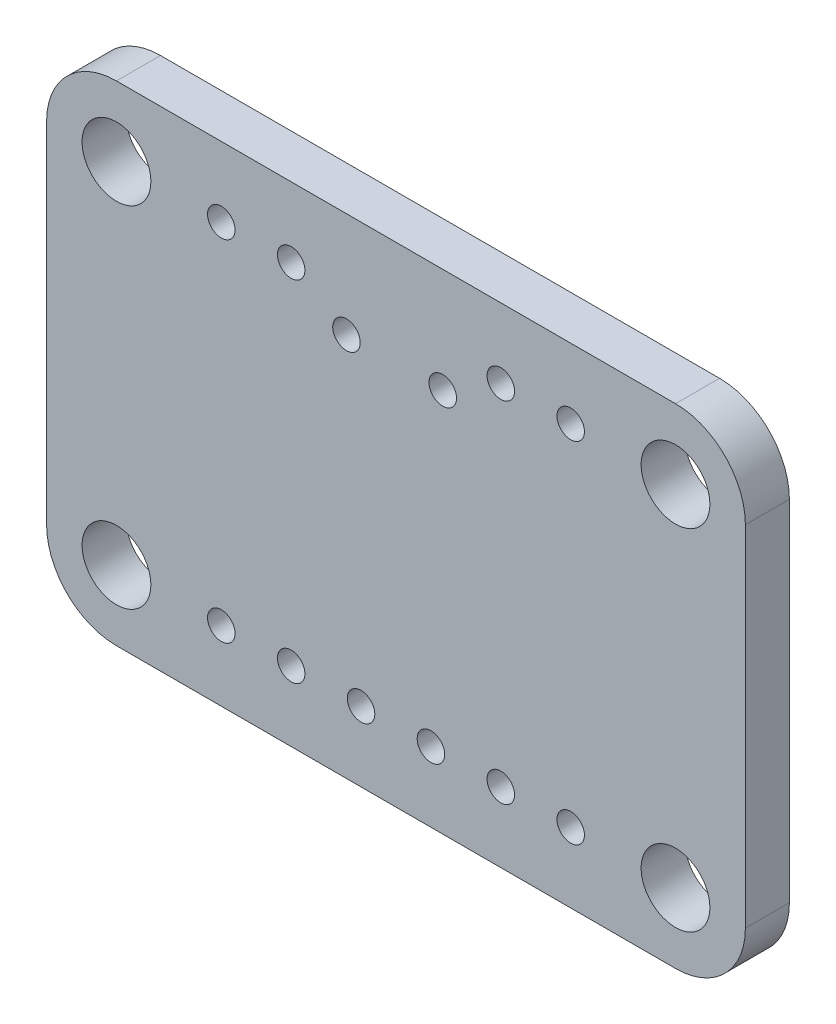
ISO-10303-21;
HEADER;
FILE_DESCRIPTION(('STEP AP214'),'2;1');
FILE_NAME('part.step','',(''),(''),'','','');
FILE_SCHEMA(('AUTOMOTIVE_DESIGN { 1 0 10303 214 1 1 1 1 }'));
ENDSEC;
DATA;
#1=APPLICATION_CONTEXT('core data for automotive mechanical design processes');
#2=APPLICATION_PROTOCOL_DEFINITION('international standard','automotive_design',2000,#1);
#3=PRODUCT_CONTEXT('',#1,'mechanical');
#4=PRODUCT('Part','Part','',(#3));
#5=PRODUCT_RELATED_PRODUCT_CATEGORY('part','',(#4));
#6=PRODUCT_DEFINITION_FORMATION('','',#4);
#7=PRODUCT_DEFINITION_CONTEXT('part definition',#1,'design');
#8=PRODUCT_DEFINITION('design','',#6,#7);
#9=PRODUCT_DEFINITION_SHAPE('','',#8);
#10=(LENGTH_UNIT() NAMED_UNIT(*) SI_UNIT(.MILLI.,.METRE.));
#11=(NAMED_UNIT(*) PLANE_ANGLE_UNIT() SI_UNIT($,.RADIAN.));
#12=(NAMED_UNIT(*) SI_UNIT($,.STERADIAN.) SOLID_ANGLE_UNIT());
#13=UNCERTAINTY_MEASURE_WITH_UNIT(LENGTH_MEASURE(1.E-05),#10,'distance_accuracy_value','');
#14=(GEOMETRIC_REPRESENTATION_CONTEXT(3) GLOBAL_UNCERTAINTY_ASSIGNED_CONTEXT((#13)) GLOBAL_UNIT_ASSIGNED_CONTEXT((#10,
#11,#12)) REPRESENTATION_CONTEXT('',''));
#15=CARTESIAN_POINT('',(0.,0.,0.));
#16=DIRECTION('',(0.,0.,1.));
#17=DIRECTION('',(1.,0.,0.));
#18=AXIS2_PLACEMENT_3D('',#15,#16,#17);
#19=CARTESIAN_POINT('',(22.86,15.24,-1.6));
#20=DIRECTION('',(0.,0.,1.));
#21=DIRECTION('',(1.,0.,0.));
#22=AXIS2_PLACEMENT_3D('',#19,#20,#21);
#23=CYLINDRICAL_SURFACE('',#22,2.54);
#24=CARTESIAN_POINT('',(22.86,15.24,0.));
#25=DIRECTION('',(0.,0.,1.));
#26=DIRECTION('',(1.,0.,0.));
#27=AXIS2_PLACEMENT_3D('',#24,#25,#26);
#28=CIRCLE('',#27,2.54);
#29=CARTESIAN_POINT('',(25.4,15.24,0.));
#30=VERTEX_POINT('',#29);
#31=CARTESIAN_POINT('',(22.86,17.78,0.));
#32=VERTEX_POINT('',#31);
#33=EDGE_CURVE('E571',#30,#32,#28,.T.);
#34=ORIENTED_EDGE('',*,*,#33,.F.);
#35=DIRECTION('',(0.,0.,1.));
#36=VECTOR('',#35,1.);
#37=CARTESIAN_POINT('',(25.4,15.24,-1.6));
#38=LINE('',#37,#36);
#39=CARTESIAN_POINT('',(25.4,15.24,-1.6));
#40=VERTEX_POINT('',#39);
#41=EDGE_CURVE('E12',#40,#30,#38,.T.);
#42=ORIENTED_EDGE('',*,*,#41,.F.);
#43=CARTESIAN_POINT('',(22.86,15.24,-1.6));
#44=DIRECTION('',(0.,0.,1.));
#45=DIRECTION('',(1.,0.,0.));
#46=AXIS2_PLACEMENT_3D('',#43,#44,#45);
#47=CIRCLE('',#46,2.54);
#48=CARTESIAN_POINT('',(22.86,17.78,-1.6));
#49=VERTEX_POINT('',#48);
#50=EDGE_CURVE('E592',#40,#49,#47,.T.);
#51=ORIENTED_EDGE('',*,*,#50,.T.);
#52=DIRECTION('',(0.,0.,1.));
#53=VECTOR('',#52,1.);
#54=CARTESIAN_POINT('',(22.86,17.78,-1.6));
#55=LINE('',#54,#53);
#56=EDGE_CURVE('E477',#49,#32,#55,.T.);
#57=ORIENTED_EDGE('',*,*,#56,.T.);
#58=EDGE_LOOP('',(#34,#42,#51,#57));
#59=FACE_BOUND('',#58,.T.);
#60=ADVANCED_FACE('F474',(#59),#23,.T.);
#61=CARTESIAN_POINT('',(25.4,2.54,-1.6));
#62=DIRECTION('',(1.,0.,0.));
#63=DIRECTION('',(0.,0.,-1.));
#64=AXIS2_PLACEMENT_3D('',#61,#62,#63);
#65=PLANE('',#64);
#66=DIRECTION('',(0.,1.,0.));
#67=VECTOR('',#66,1.);
#68=CARTESIAN_POINT('',(25.4,2.54,0.));
#69=LINE('',#68,#67);
#70=CARTESIAN_POINT('',(25.4,2.54,0.));
#71=VERTEX_POINT('',#70);
#72=EDGE_CURVE('E590',#71,#30,#69,.T.);
#73=ORIENTED_EDGE('',*,*,#72,.F.);
#74=DIRECTION('',(0.,0.,1.));
#75=VECTOR('',#74,1.);
#76=CARTESIAN_POINT('',(25.4,2.54,-1.6));
#77=LINE('',#76,#75);
#78=CARTESIAN_POINT('',(25.4,2.54,-1.6));
#79=VERTEX_POINT('',#78);
#80=EDGE_CURVE('E483',#79,#71,#77,.T.);
#81=ORIENTED_EDGE('',*,*,#80,.F.);
#82=DIRECTION('',(0.,1.,0.));
#83=VECTOR('',#82,1.);
#84=CARTESIAN_POINT('',(25.4,2.54,-1.6));
#85=LINE('',#84,#83);
#86=EDGE_CURVE('E561',#79,#40,#85,.T.);
#87=ORIENTED_EDGE('',*,*,#86,.T.);
#88=ORIENTED_EDGE('',*,*,#41,.T.);
#89=EDGE_LOOP('',(#73,#81,#87,#88));
#90=FACE_BOUND('',#89,.T.);
#91=ADVANCED_FACE('F604',(#90),#65,.T.);
#92=CARTESIAN_POINT('',(22.86,2.54,-1.6));
#93=DIRECTION('',(0.,0.,1.));
#94=DIRECTION('',(1.,0.,0.));
#95=AXIS2_PLACEMENT_3D('',#92,#93,#94);
#96=CYLINDRICAL_SURFACE('',#95,2.54);
#97=CARTESIAN_POINT('',(22.86,2.54,0.));
#98=DIRECTION('',(0.,0.,1.));
#99=DIRECTION('',(1.,0.,0.));
#100=AXIS2_PLACEMENT_3D('',#97,#98,#99);
#101=CIRCLE('',#100,2.54);
#102=CARTESIAN_POINT('',(22.86,0.,0.));
#103=VERTEX_POINT('',#102);
#104=EDGE_CURVE('E548',#103,#71,#101,.T.);
#105=ORIENTED_EDGE('',*,*,#104,.F.);
#106=DIRECTION('',(0.,0.,1.));
#107=VECTOR('',#106,1.);
#108=CARTESIAN_POINT('',(22.86,0.,-1.6));
#109=LINE('',#108,#107);
#110=CARTESIAN_POINT('',(22.86,0.,-1.6));
#111=VERTEX_POINT('',#110);
#112=EDGE_CURVE('E543',#111,#103,#109,.T.);
#113=ORIENTED_EDGE('',*,*,#112,.F.);
#114=CARTESIAN_POINT('',(22.86,2.54,-1.6));
#115=DIRECTION('',(0.,0.,1.));
#116=DIRECTION('',(1.,0.,0.));
#117=AXIS2_PLACEMENT_3D('',#114,#115,#116);
#118=CIRCLE('',#117,2.54);
#119=EDGE_CURVE('E546',#111,#79,#118,.T.);
#120=ORIENTED_EDGE('',*,*,#119,.T.);
#121=ORIENTED_EDGE('',*,*,#80,.T.);
#122=EDGE_LOOP('',(#105,#113,#120,#121));
#123=FACE_BOUND('',#122,.T.);
#124=ADVANCED_FACE('F545',(#123),#96,.T.);
#125=CARTESIAN_POINT('',(2.54,0.,-1.6));
#126=DIRECTION('',(0.,-1.,0.));
#127=DIRECTION('',(0.,0.,-1.));
#128=AXIS2_PLACEMENT_3D('',#125,#126,#127);
#129=PLANE('',#128);
#130=DIRECTION('',(1.,0.,0.));
#131=VECTOR('',#130,1.);
#132=CARTESIAN_POINT('',(2.54,0.,0.));
#133=LINE('',#132,#131);
#134=CARTESIAN_POINT('',(2.54,0.,0.));
#135=VERTEX_POINT('',#134);
#136=EDGE_CURVE('E587',#135,#103,#133,.T.);
#137=ORIENTED_EDGE('',*,*,#136,.F.);
#138=DIRECTION('',(0.,0.,1.));
#139=VECTOR('',#138,1.);
#140=CARTESIAN_POINT('',(2.54,0.,-1.6));
#141=LINE('',#140,#139);
#142=CARTESIAN_POINT('',(2.54,0.,-1.6));
#143=VERTEX_POINT('',#142);
#144=EDGE_CURVE('E553',#143,#135,#141,.T.);
#145=ORIENTED_EDGE('',*,*,#144,.F.);
#146=DIRECTION('',(1.,0.,0.));
#147=VECTOR('',#146,1.);
#148=CARTESIAN_POINT('',(2.54,0.,-1.6));
#149=LINE('',#148,#147);
#150=EDGE_CURVE('E559',#143,#111,#149,.T.);
#151=ORIENTED_EDGE('',*,*,#150,.T.);
#152=ORIENTED_EDGE('',*,*,#112,.T.);
#153=EDGE_LOOP('',(#137,#145,#151,#152));
#154=FACE_BOUND('',#153,.T.);
#155=ADVANCED_FACE('F563',(#154),#129,.T.);
#156=CARTESIAN_POINT('',(2.54,2.54,-1.6));
#157=DIRECTION('',(0.,0.,1.));
#158=DIRECTION('',(1.,0.,0.));
#159=AXIS2_PLACEMENT_3D('',#156,#157,#158);
#160=CYLINDRICAL_SURFACE('',#159,2.54);
#161=CARTESIAN_POINT('',(2.54,2.54,0.));
#162=DIRECTION('',(0.,0.,1.));
#163=DIRECTION('',(1.,0.,0.));
#164=AXIS2_PLACEMENT_3D('',#161,#162,#163);
#165=CIRCLE('',#164,2.54);
#166=CARTESIAN_POINT('',(0.,2.54,0.));
#167=VERTEX_POINT('',#166);
#168=EDGE_CURVE('E584',#167,#135,#165,.T.);
#169=ORIENTED_EDGE('',*,*,#168,.F.);
#170=DIRECTION('',(0.,0.,1.));
#171=VECTOR('',#170,1.);
#172=CARTESIAN_POINT('',(0.,2.54,-1.6));
#173=LINE('',#172,#171);
#174=CARTESIAN_POINT('',(0.,2.54,-1.6));
#175=VERTEX_POINT('',#174);
#176=EDGE_CURVE('E596',#175,#167,#173,.T.);
#177=ORIENTED_EDGE('',*,*,#176,.F.);
#178=CARTESIAN_POINT('',(2.54,2.54,-1.6));
#179=DIRECTION('',(0.,0.,1.));
#180=DIRECTION('',(1.,0.,0.));
#181=AXIS2_PLACEMENT_3D('',#178,#179,#180);
#182=CIRCLE('',#181,2.54);
#183=EDGE_CURVE('E564',#175,#143,#182,.T.);
#184=ORIENTED_EDGE('',*,*,#183,.T.);
#185=ORIENTED_EDGE('',*,*,#144,.T.);
#186=EDGE_LOOP('',(#169,#177,#184,#185));
#187=FACE_BOUND('',#186,.T.);
#188=ADVANCED_FACE('F617',(#187),#160,.T.);
#189=CARTESIAN_POINT('',(0.,15.24,-1.6));
#190=DIRECTION('',(-1.,0.,0.));
#191=DIRECTION('',(0.,0.,1.));
#192=AXIS2_PLACEMENT_3D('',#189,#190,#191);
#193=PLANE('',#192);
#194=DIRECTION('',(0.,-1.,0.));
#195=VECTOR('',#194,1.);
#196=CARTESIAN_POINT('',(0.,15.24,0.));
#197=LINE('',#196,#195);
#198=CARTESIAN_POINT('',(0.,15.24,0.));
#199=VERTEX_POINT('',#198);
#200=EDGE_CURVE('E581',#199,#167,#197,.T.);
#201=ORIENTED_EDGE('',*,*,#200,.F.);
#202=DIRECTION('',(0.,0.,1.));
#203=VECTOR('',#202,1.);
#204=CARTESIAN_POINT('',(0.,15.24,-1.6));
#205=LINE('',#204,#203);
#206=CARTESIAN_POINT('',(0.,15.24,-1.6));
#207=VERTEX_POINT('',#206);
#208=EDGE_CURVE('E598',#207,#199,#205,.T.);
#209=ORIENTED_EDGE('',*,*,#208,.F.);
#210=DIRECTION('',(0.,-1.,0.));
#211=VECTOR('',#210,1.);
#212=CARTESIAN_POINT('',(0.,15.24,-1.6));
#213=LINE('',#212,#211);
#214=EDGE_CURVE('E566',#207,#175,#213,.T.);
#215=ORIENTED_EDGE('',*,*,#214,.T.);
#216=ORIENTED_EDGE('',*,*,#176,.T.);
#217=EDGE_LOOP('',(#201,#209,#215,#216));
#218=FACE_BOUND('',#217,.T.);
#219=ADVANCED_FACE('F620',(#218),#193,.T.);
#220=CARTESIAN_POINT('',(2.54,15.24,-1.6));
#221=DIRECTION('',(0.,0.,1.));
#222=DIRECTION('',(1.,0.,0.));
#223=AXIS2_PLACEMENT_3D('',#220,#221,#222);
#224=CYLINDRICAL_SURFACE('',#223,2.54);
#225=CARTESIAN_POINT('',(2.54,15.24,0.));
#226=DIRECTION('',(0.,0.,1.));
#227=DIRECTION('',(1.,0.,0.));
#228=AXIS2_PLACEMENT_3D('',#225,#226,#227);
#229=CIRCLE('',#228,2.54);
#230=CARTESIAN_POINT('',(2.54,17.78,0.));
#231=VERTEX_POINT('',#230);
#232=EDGE_CURVE('E578',#231,#199,#229,.T.);
#233=ORIENTED_EDGE('',*,*,#232,.F.);
#234=DIRECTION('',(0.,0.,1.));
#235=VECTOR('',#234,1.);
#236=CARTESIAN_POINT('',(2.54,17.78,-1.6));
#237=LINE('',#236,#235);
#238=CARTESIAN_POINT('',(2.54,17.78,-1.6));
#239=VERTEX_POINT('',#238);
#240=EDGE_CURVE('E599',#239,#231,#237,.T.);
#241=ORIENTED_EDGE('',*,*,#240,.F.);
#242=CARTESIAN_POINT('',(2.54,15.24,-1.6));
#243=DIRECTION('',(0.,0.,1.));
#244=DIRECTION('',(1.,0.,0.));
#245=AXIS2_PLACEMENT_3D('',#242,#243,#244);
#246=CIRCLE('',#245,2.54);
#247=EDGE_CURVE('E806',#239,#207,#246,.T.);
#248=ORIENTED_EDGE('',*,*,#247,.T.);
#249=ORIENTED_EDGE('',*,*,#208,.T.);
#250=EDGE_LOOP('',(#233,#241,#248,#249));
#251=FACE_BOUND('',#250,.T.);
#252=ADVANCED_FACE('F624',(#251),#224,.T.);
#253=CARTESIAN_POINT('',(22.86,17.78,-1.6));
#254=DIRECTION('',(0.,1.,0.));
#255=DIRECTION('',(0.,0.,1.));
#256=AXIS2_PLACEMENT_3D('',#253,#254,#255);
#257=PLANE('',#256);
#258=DIRECTION('',(-1.,0.,0.));
#259=VECTOR('',#258,1.);
#260=CARTESIAN_POINT('',(22.86,17.78,0.));
#261=LINE('',#260,#259);
#262=EDGE_CURVE('E574',#32,#231,#261,.T.);
#263=ORIENTED_EDGE('',*,*,#262,.F.);
#264=ORIENTED_EDGE('',*,*,#56,.F.);
#265=DIRECTION('',(-1.,0.,0.));
#266=VECTOR('',#265,1.);
#267=CARTESIAN_POINT('',(22.86,17.78,-1.6));
#268=LINE('',#267,#266);
#269=EDGE_CURVE('E804',#49,#239,#268,.T.);
#270=ORIENTED_EDGE('',*,*,#269,.T.);
#271=ORIENTED_EDGE('',*,*,#240,.T.);
#272=EDGE_LOOP('',(#263,#264,#270,#271));
#273=FACE_BOUND('',#272,.T.);
#274=ADVANCED_FACE('F601',(#273),#257,.T.);
#275=CARTESIAN_POINT('',(22.86,15.24,-1.6));
#276=DIRECTION('',(0.,0.,1.));
#277=DIRECTION('',(1.,0.,0.));
#278=AXIS2_PLACEMENT_3D('',#275,#276,#277);
#279=PLANE('',#278);
#280=CARTESIAN_POINT('',(2.54,15.24,-1.6));
#281=DIRECTION('',(0.,0.,1.));
#282=DIRECTION('',(1.,0.,0.));
#283=AXIS2_PLACEMENT_3D('',#280,#281,#282);
#284=CIRCLE('',#283,1.25);
#285=CARTESIAN_POINT('',(3.79,15.24,-1.6));
#286=VERTEX_POINT('',#285);
#287=EDGE_CURVE('E707',#286,#286,#284,.T.);
#288=ORIENTED_EDGE('',*,*,#287,.T.);
#289=EDGE_LOOP('',(#288));
#290=FACE_BOUND('',#289,.T.);
#291=CARTESIAN_POINT('',(22.86,15.24,-1.6));
#292=DIRECTION('',(0.,0.,1.));
#293=DIRECTION('',(1.,0.,0.));
#294=AXIS2_PLACEMENT_3D('',#291,#292,#293);
#295=CIRCLE('',#294,1.25);
#296=CARTESIAN_POINT('',(24.11,15.24,-1.6));
#297=VERTEX_POINT('',#296);
#298=EDGE_CURVE('E715',#297,#297,#295,.T.);
#299=ORIENTED_EDGE('',*,*,#298,.T.);
#300=EDGE_LOOP('',(#299));
#301=FACE_BOUND('',#300,.T.);
#302=CARTESIAN_POINT('',(10.9,13.97,-1.6));
#303=DIRECTION('',(0.,0.,1.));
#304=DIRECTION('',(1.,0.,0.));
#305=AXIS2_PLACEMENT_3D('',#302,#303,#304);
#306=CIRCLE('',#305,0.5);
#307=CARTESIAN_POINT('',(11.4,13.97,-1.6));
#308=VERTEX_POINT('',#307);
#309=EDGE_CURVE('E721',#308,#308,#306,.T.);
#310=ORIENTED_EDGE('',*,*,#309,.T.);
#311=EDGE_LOOP('',(#310));
#312=FACE_BOUND('',#311,.T.);
#313=CARTESIAN_POINT('',(14.4,13.97,-1.6));
#314=DIRECTION('',(0.,0.,1.));
#315=DIRECTION('',(1.,0.,0.));
#316=AXIS2_PLACEMENT_3D('',#313,#314,#315);
#317=CIRCLE('',#316,0.5);
#318=CARTESIAN_POINT('',(14.9,13.97,-1.6));
#319=VERTEX_POINT('',#318);
#320=EDGE_CURVE('E727',#319,#319,#317,.T.);
#321=ORIENTED_EDGE('',*,*,#320,.T.);
#322=EDGE_LOOP('',(#321));
#323=FACE_BOUND('',#322,.T.);
#324=CARTESIAN_POINT('',(2.54,2.54,-1.6));
#325=DIRECTION('',(0.,0.,1.));
#326=DIRECTION('',(1.,0.,0.));
#327=AXIS2_PLACEMENT_3D('',#324,#325,#326);
#328=CIRCLE('',#327,1.25);
#329=CARTESIAN_POINT('',(3.79,2.54,-1.6));
#330=VERTEX_POINT('',#329);
#331=EDGE_CURVE('E733',#330,#330,#328,.T.);
#332=ORIENTED_EDGE('',*,*,#331,.T.);
#333=EDGE_LOOP('',(#332));
#334=FACE_BOUND('',#333,.T.);
#335=CARTESIAN_POINT('',(22.86,2.54,-1.6));
#336=DIRECTION('',(0.,0.,1.));
#337=DIRECTION('',(1.,0.,0.));
#338=AXIS2_PLACEMENT_3D('',#335,#336,#337);
#339=CIRCLE('',#338,1.25);
#340=CARTESIAN_POINT('',(24.11,2.54,-1.6));
#341=VERTEX_POINT('',#340);
#342=EDGE_CURVE('E739',#341,#341,#339,.T.);
#343=ORIENTED_EDGE('',*,*,#342,.T.);
#344=EDGE_LOOP('',(#343));
#345=FACE_BOUND('',#344,.T.);
#346=CARTESIAN_POINT('',(6.35,15.24,-1.6));
#347=DIRECTION('',(0.,0.,1.));
#348=DIRECTION('',(1.,0.,0.));
#349=AXIS2_PLACEMENT_3D('',#346,#347,#348);
#350=CIRCLE('',#349,0.5);
#351=CARTESIAN_POINT('',(6.85,15.24,-1.6));
#352=VERTEX_POINT('',#351);
#353=EDGE_CURVE('E745',#352,#352,#350,.T.);
#354=ORIENTED_EDGE('',*,*,#353,.T.);
#355=EDGE_LOOP('',(#354));
#356=FACE_BOUND('',#355,.T.);
#357=CARTESIAN_POINT('',(8.89,15.24,-1.6));
#358=DIRECTION('',(0.,0.,1.));
#359=DIRECTION('',(1.,0.,0.));
#360=AXIS2_PLACEMENT_3D('',#357,#358,#359);
#361=CIRCLE('',#360,0.5);
#362=CARTESIAN_POINT('',(9.39,15.24,-1.6));
#363=VERTEX_POINT('',#362);
#364=EDGE_CURVE('E751',#363,#363,#361,.T.);
#365=ORIENTED_EDGE('',*,*,#364,.T.);
#366=EDGE_LOOP('',(#365));
#367=FACE_BOUND('',#366,.T.);
#368=CARTESIAN_POINT('',(16.51,15.24,-1.6));
#369=DIRECTION('',(0.,0.,1.));
#370=DIRECTION('',(1.,0.,0.));
#371=AXIS2_PLACEMENT_3D('',#368,#369,#370);
#372=CIRCLE('',#371,0.5);
#373=CARTESIAN_POINT('',(17.01,15.24,-1.6));
#374=VERTEX_POINT('',#373);
#375=EDGE_CURVE('E757',#374,#374,#372,.T.);
#376=ORIENTED_EDGE('',*,*,#375,.T.);
#377=EDGE_LOOP('',(#376));
#378=FACE_BOUND('',#377,.T.);
#379=CARTESIAN_POINT('',(19.05,15.24,-1.6));
#380=DIRECTION('',(0.,0.,1.));
#381=DIRECTION('',(1.,0.,0.));
#382=AXIS2_PLACEMENT_3D('',#379,#380,#381);
#383=CIRCLE('',#382,0.5);
#384=CARTESIAN_POINT('',(19.55,15.24,-1.6));
#385=VERTEX_POINT('',#384);
#386=EDGE_CURVE('E763',#385,#385,#383,.T.);
#387=ORIENTED_EDGE('',*,*,#386,.T.);
#388=EDGE_LOOP('',(#387));
#389=FACE_BOUND('',#388,.T.);
#390=CARTESIAN_POINT('',(11.43,2.54,-1.6));
#391=DIRECTION('',(0.,0.,1.));
#392=DIRECTION('',(1.,0.,0.));
#393=AXIS2_PLACEMENT_3D('',#390,#391,#392);
#394=CIRCLE('',#393,0.5);
#395=CARTESIAN_POINT('',(11.93,2.54,-1.6));
#396=VERTEX_POINT('',#395);
#397=EDGE_CURVE('E769',#396,#396,#394,.T.);
#398=ORIENTED_EDGE('',*,*,#397,.T.);
#399=EDGE_LOOP('',(#398));
#400=FACE_BOUND('',#399,.T.);
#401=CARTESIAN_POINT('',(13.97,2.54,-1.6));
#402=DIRECTION('',(0.,0.,1.));
#403=DIRECTION('',(1.,0.,0.));
#404=AXIS2_PLACEMENT_3D('',#401,#402,#403);
#405=CIRCLE('',#404,0.5);
#406=CARTESIAN_POINT('',(14.47,2.54,-1.6));
#407=VERTEX_POINT('',#406);
#408=EDGE_CURVE('E775',#407,#407,#405,.T.);
#409=ORIENTED_EDGE('',*,*,#408,.T.);
#410=EDGE_LOOP('',(#409));
#411=FACE_BOUND('',#410,.T.);
#412=CARTESIAN_POINT('',(16.51,2.54,-1.6));
#413=DIRECTION('',(0.,0.,1.));
#414=DIRECTION('',(1.,0.,0.));
#415=AXIS2_PLACEMENT_3D('',#412,#413,#414);
#416=CIRCLE('',#415,0.5);
#417=CARTESIAN_POINT('',(17.01,2.54,-1.6));
#418=VERTEX_POINT('',#417);
#419=EDGE_CURVE('E781',#418,#418,#416,.T.);
#420=ORIENTED_EDGE('',*,*,#419,.T.);
#421=EDGE_LOOP('',(#420));
#422=FACE_BOUND('',#421,.T.);
#423=CARTESIAN_POINT('',(19.05,2.54,-1.6));
#424=DIRECTION('',(0.,0.,1.));
#425=DIRECTION('',(1.,0.,0.));
#426=AXIS2_PLACEMENT_3D('',#423,#424,#425);
#427=CIRCLE('',#426,0.5);
#428=CARTESIAN_POINT('',(19.55,2.54,-1.6));
#429=VERTEX_POINT('',#428);
#430=EDGE_CURVE('E787',#429,#429,#427,.T.);
#431=ORIENTED_EDGE('',*,*,#430,.T.);
#432=EDGE_LOOP('',(#431));
#433=FACE_BOUND('',#432,.T.);
#434=CARTESIAN_POINT('',(6.35,2.54,-1.6));
#435=DIRECTION('',(0.,0.,1.));
#436=DIRECTION('',(1.,0.,0.));
#437=AXIS2_PLACEMENT_3D('',#434,#435,#436);
#438=CIRCLE('',#437,0.5);
#439=CARTESIAN_POINT('',(6.85,2.54,-1.6));
#440=VERTEX_POINT('',#439);
#441=EDGE_CURVE('E793',#440,#440,#438,.T.);
#442=ORIENTED_EDGE('',*,*,#441,.T.);
#443=EDGE_LOOP('',(#442));
#444=FACE_BOUND('',#443,.T.);
#445=CARTESIAN_POINT('',(8.89,2.54,-1.6));
#446=DIRECTION('',(0.,0.,1.));
#447=DIRECTION('',(1.,0.,0.));
#448=AXIS2_PLACEMENT_3D('',#445,#446,#447);
#449=CIRCLE('',#448,0.5);
#450=CARTESIAN_POINT('',(9.39,2.54,-1.6));
#451=VERTEX_POINT('',#450);
#452=EDGE_CURVE('E575',#451,#451,#449,.T.);
#453=ORIENTED_EDGE('',*,*,#452,.T.);
#454=EDGE_LOOP('',(#453));
#455=FACE_BOUND('',#454,.T.);
#456=ORIENTED_EDGE('',*,*,#50,.F.);
#457=ORIENTED_EDGE('',*,*,#86,.F.);
#458=ORIENTED_EDGE('',*,*,#119,.F.);
#459=ORIENTED_EDGE('',*,*,#150,.F.);
#460=ORIENTED_EDGE('',*,*,#183,.F.);
#461=ORIENTED_EDGE('',*,*,#214,.F.);
#462=ORIENTED_EDGE('',*,*,#247,.F.);
#463=ORIENTED_EDGE('',*,*,#269,.F.);
#464=EDGE_LOOP('',(#456,#457,#458,#459,#460,#461,#462,#463));
#465=FACE_BOUND('',#464,.T.);
#466=ADVANCED_FACE('F557',(#290,#301,#312,#323,#334,#345,#356,#367,#378,#389,#400,#411,#422,
#433,#444,#455,#465),#279,.F.);
#467=CARTESIAN_POINT('',(22.86,15.24,0.));
#468=DIRECTION('',(0.,0.,1.));
#469=DIRECTION('',(1.,0.,0.));
#470=AXIS2_PLACEMENT_3D('',#467,#468,#469);
#471=PLANE('',#470);
#472=CARTESIAN_POINT('',(2.54,15.24,0.));
#473=DIRECTION('',(0.,0.,1.));
#474=DIRECTION('',(1.,0.,0.));
#475=AXIS2_PLACEMENT_3D('',#472,#473,#474);
#476=CIRCLE('',#475,1.25);
#477=CARTESIAN_POINT('',(3.79,15.24,0.));
#478=VERTEX_POINT('',#477);
#479=EDGE_CURVE('E710',#478,#478,#476,.T.);
#480=ORIENTED_EDGE('',*,*,#479,.F.);
#481=EDGE_LOOP('',(#480));
#482=FACE_BOUND('',#481,.T.);
#483=CARTESIAN_POINT('',(22.86,15.24,0.));
#484=DIRECTION('',(0.,0.,1.));
#485=DIRECTION('',(1.,0.,0.));
#486=AXIS2_PLACEMENT_3D('',#483,#484,#485);
#487=CIRCLE('',#486,1.25);
#488=CARTESIAN_POINT('',(24.11,15.24,0.));
#489=VERTEX_POINT('',#488);
#490=EDGE_CURVE('E712',#489,#489,#487,.T.);
#491=ORIENTED_EDGE('',*,*,#490,.F.);
#492=EDGE_LOOP('',(#491));
#493=FACE_BOUND('',#492,.T.);
#494=CARTESIAN_POINT('',(10.9,13.97,0.));
#495=DIRECTION('',(0.,0.,1.));
#496=DIRECTION('',(1.,0.,0.));
#497=AXIS2_PLACEMENT_3D('',#494,#495,#496);
#498=CIRCLE('',#497,0.5);
#499=CARTESIAN_POINT('',(11.4,13.97,0.));
#500=VERTEX_POINT('',#499);
#501=EDGE_CURVE('E718',#500,#500,#498,.T.);
#502=ORIENTED_EDGE('',*,*,#501,.F.);
#503=EDGE_LOOP('',(#502));
#504=FACE_BOUND('',#503,.T.);
#505=CARTESIAN_POINT('',(14.4,13.97,0.));
#506=DIRECTION('',(0.,0.,1.));
#507=DIRECTION('',(1.,0.,0.));
#508=AXIS2_PLACEMENT_3D('',#505,#506,#507);
#509=CIRCLE('',#508,0.5);
#510=CARTESIAN_POINT('',(14.9,13.97,0.));
#511=VERTEX_POINT('',#510);
#512=EDGE_CURVE('E724',#511,#511,#509,.T.);
#513=ORIENTED_EDGE('',*,*,#512,.F.);
#514=EDGE_LOOP('',(#513));
#515=FACE_BOUND('',#514,.T.);
#516=CARTESIAN_POINT('',(2.54,2.54,0.));
#517=DIRECTION('',(0.,0.,1.));
#518=DIRECTION('',(1.,0.,0.));
#519=AXIS2_PLACEMENT_3D('',#516,#517,#518);
#520=CIRCLE('',#519,1.25);
#521=CARTESIAN_POINT('',(3.79,2.54,0.));
#522=VERTEX_POINT('',#521);
#523=EDGE_CURVE('E730',#522,#522,#520,.T.);
#524=ORIENTED_EDGE('',*,*,#523,.F.);
#525=EDGE_LOOP('',(#524));
#526=FACE_BOUND('',#525,.T.);
#527=CARTESIAN_POINT('',(22.86,2.54,0.));
#528=DIRECTION('',(0.,0.,1.));
#529=DIRECTION('',(1.,0.,0.));
#530=AXIS2_PLACEMENT_3D('',#527,#528,#529);
#531=CIRCLE('',#530,1.25);
#532=CARTESIAN_POINT('',(24.11,2.54,0.));
#533=VERTEX_POINT('',#532);
#534=EDGE_CURVE('E736',#533,#533,#531,.T.);
#535=ORIENTED_EDGE('',*,*,#534,.F.);
#536=EDGE_LOOP('',(#535));
#537=FACE_BOUND('',#536,.T.);
#538=CARTESIAN_POINT('',(6.35,15.24,0.));
#539=DIRECTION('',(0.,0.,1.));
#540=DIRECTION('',(1.,0.,0.));
#541=AXIS2_PLACEMENT_3D('',#538,#539,#540);
#542=CIRCLE('',#541,0.5);
#543=CARTESIAN_POINT('',(6.85,15.24,0.));
#544=VERTEX_POINT('',#543);
#545=EDGE_CURVE('E742',#544,#544,#542,.T.);
#546=ORIENTED_EDGE('',*,*,#545,.F.);
#547=EDGE_LOOP('',(#546));
#548=FACE_BOUND('',#547,.T.);
#549=CARTESIAN_POINT('',(8.89,15.24,0.));
#550=DIRECTION('',(0.,0.,1.));
#551=DIRECTION('',(1.,0.,0.));
#552=AXIS2_PLACEMENT_3D('',#549,#550,#551);
#553=CIRCLE('',#552,0.5);
#554=CARTESIAN_POINT('',(9.39,15.24,0.));
#555=VERTEX_POINT('',#554);
#556=EDGE_CURVE('E748',#555,#555,#553,.T.);
#557=ORIENTED_EDGE('',*,*,#556,.F.);
#558=EDGE_LOOP('',(#557));
#559=FACE_BOUND('',#558,.T.);
#560=CARTESIAN_POINT('',(16.51,15.24,0.));
#561=DIRECTION('',(0.,0.,1.));
#562=DIRECTION('',(1.,0.,0.));
#563=AXIS2_PLACEMENT_3D('',#560,#561,#562);
#564=CIRCLE('',#563,0.5);
#565=CARTESIAN_POINT('',(17.01,15.24,0.));
#566=VERTEX_POINT('',#565);
#567=EDGE_CURVE('E754',#566,#566,#564,.T.);
#568=ORIENTED_EDGE('',*,*,#567,.F.);
#569=EDGE_LOOP('',(#568));
#570=FACE_BOUND('',#569,.T.);
#571=CARTESIAN_POINT('',(19.05,15.24,0.));
#572=DIRECTION('',(0.,0.,1.));
#573=DIRECTION('',(1.,0.,0.));
#574=AXIS2_PLACEMENT_3D('',#571,#572,#573);
#575=CIRCLE('',#574,0.5);
#576=CARTESIAN_POINT('',(19.55,15.24,0.));
#577=VERTEX_POINT('',#576);
#578=EDGE_CURVE('E760',#577,#577,#575,.T.);
#579=ORIENTED_EDGE('',*,*,#578,.F.);
#580=EDGE_LOOP('',(#579));
#581=FACE_BOUND('',#580,.T.);
#582=CARTESIAN_POINT('',(11.43,2.54,0.));
#583=DIRECTION('',(0.,0.,1.));
#584=DIRECTION('',(1.,0.,0.));
#585=AXIS2_PLACEMENT_3D('',#582,#583,#584);
#586=CIRCLE('',#585,0.5);
#587=CARTESIAN_POINT('',(11.93,2.54,0.));
#588=VERTEX_POINT('',#587);
#589=EDGE_CURVE('E766',#588,#588,#586,.T.);
#590=ORIENTED_EDGE('',*,*,#589,.F.);
#591=EDGE_LOOP('',(#590));
#592=FACE_BOUND('',#591,.T.);
#593=CARTESIAN_POINT('',(13.97,2.54,0.));
#594=DIRECTION('',(0.,0.,1.));
#595=DIRECTION('',(1.,0.,0.));
#596=AXIS2_PLACEMENT_3D('',#593,#594,#595);
#597=CIRCLE('',#596,0.5);
#598=CARTESIAN_POINT('',(14.47,2.54,0.));
#599=VERTEX_POINT('',#598);
#600=EDGE_CURVE('E772',#599,#599,#597,.T.);
#601=ORIENTED_EDGE('',*,*,#600,.F.);
#602=EDGE_LOOP('',(#601));
#603=FACE_BOUND('',#602,.T.);
#604=CARTESIAN_POINT('',(16.51,2.54,0.));
#605=DIRECTION('',(0.,0.,1.));
#606=DIRECTION('',(1.,0.,0.));
#607=AXIS2_PLACEMENT_3D('',#604,#605,#606);
#608=CIRCLE('',#607,0.5);
#609=CARTESIAN_POINT('',(17.01,2.54,0.));
#610=VERTEX_POINT('',#609);
#611=EDGE_CURVE('E778',#610,#610,#608,.T.);
#612=ORIENTED_EDGE('',*,*,#611,.F.);
#613=EDGE_LOOP('',(#612));
#614=FACE_BOUND('',#613,.T.);
#615=CARTESIAN_POINT('',(19.05,2.54,0.));
#616=DIRECTION('',(0.,0.,1.));
#617=DIRECTION('',(1.,0.,0.));
#618=AXIS2_PLACEMENT_3D('',#615,#616,#617);
#619=CIRCLE('',#618,0.5);
#620=CARTESIAN_POINT('',(19.55,2.54,0.));
#621=VERTEX_POINT('',#620);
#622=EDGE_CURVE('E784',#621,#621,#619,.T.);
#623=ORIENTED_EDGE('',*,*,#622,.F.);
#624=EDGE_LOOP('',(#623));
#625=FACE_BOUND('',#624,.T.);
#626=CARTESIAN_POINT('',(6.35,2.54,0.));
#627=DIRECTION('',(0.,0.,1.));
#628=DIRECTION('',(1.,0.,0.));
#629=AXIS2_PLACEMENT_3D('',#626,#627,#628);
#630=CIRCLE('',#629,0.5);
#631=CARTESIAN_POINT('',(6.85,2.54,0.));
#632=VERTEX_POINT('',#631);
#633=EDGE_CURVE('E790',#632,#632,#630,.T.);
#634=ORIENTED_EDGE('',*,*,#633,.F.);
#635=EDGE_LOOP('',(#634));
#636=FACE_BOUND('',#635,.T.);
#637=CARTESIAN_POINT('',(8.89,2.54,0.));
#638=DIRECTION('',(0.,0.,1.));
#639=DIRECTION('',(1.,0.,0.));
#640=AXIS2_PLACEMENT_3D('',#637,#638,#639);
#641=CIRCLE('',#640,0.5);
#642=CARTESIAN_POINT('',(9.39,2.54,0.));
#643=VERTEX_POINT('',#642);
#644=EDGE_CURVE('E796',#643,#643,#641,.T.);
#645=ORIENTED_EDGE('',*,*,#644,.F.);
#646=EDGE_LOOP('',(#645));
#647=FACE_BOUND('',#646,.T.);
#648=ORIENTED_EDGE('',*,*,#33,.T.);
#649=ORIENTED_EDGE('',*,*,#262,.T.);
#650=ORIENTED_EDGE('',*,*,#232,.T.);
#651=ORIENTED_EDGE('',*,*,#200,.T.);
#652=ORIENTED_EDGE('',*,*,#168,.T.);
#653=ORIENTED_EDGE('',*,*,#136,.T.);
#654=ORIENTED_EDGE('',*,*,#104,.T.);
#655=ORIENTED_EDGE('',*,*,#72,.T.);
#656=EDGE_LOOP('',(#648,#649,#650,#651,#652,#653,#654,#655));
#657=FACE_BOUND('',#656,.T.);
#658=ADVANCED_FACE('F603',(#482,#493,#504,#515,#526,#537,#548,#559,#570,#581,#592,#603,#614,
#625,#636,#647,#657),#471,.T.);
#659=CARTESIAN_POINT('',(8.89,2.54,-1.6));
#660=DIRECTION('',(0.,0.,1.));
#661=DIRECTION('',(1.,0.,0.));
#662=AXIS2_PLACEMENT_3D('',#659,#660,#661);
#663=CYLINDRICAL_SURFACE('',#662,0.5);
#664=ORIENTED_EDGE('',*,*,#452,.F.);
#665=EDGE_LOOP('',(#664));
#666=FACE_BOUND('',#665,.T.);
#667=ORIENTED_EDGE('',*,*,#644,.T.);
#668=EDGE_LOOP('',(#667));
#669=FACE_BOUND('',#668,.T.);
#670=ADVANCED_FACE('F636',(#666,#669),#663,.F.);
#671=CARTESIAN_POINT('',(6.35,2.54,-1.6));
#672=DIRECTION('',(0.,0.,1.));
#673=DIRECTION('',(1.,0.,0.));
#674=AXIS2_PLACEMENT_3D('',#671,#672,#673);
#675=CYLINDRICAL_SURFACE('',#674,0.5);
#676=ORIENTED_EDGE('',*,*,#441,.F.);
#677=EDGE_LOOP('',(#676));
#678=FACE_BOUND('',#677,.T.);
#679=ORIENTED_EDGE('',*,*,#633,.T.);
#680=EDGE_LOOP('',(#679));
#681=FACE_BOUND('',#680,.T.);
#682=ADVANCED_FACE('F643',(#678,#681),#675,.F.);
#683=CARTESIAN_POINT('',(19.05,2.54,-1.6));
#684=DIRECTION('',(0.,0.,1.));
#685=DIRECTION('',(1.,0.,0.));
#686=AXIS2_PLACEMENT_3D('',#683,#684,#685);
#687=CYLINDRICAL_SURFACE('',#686,0.5);
#688=ORIENTED_EDGE('',*,*,#430,.F.);
#689=EDGE_LOOP('',(#688));
#690=FACE_BOUND('',#689,.T.);
#691=ORIENTED_EDGE('',*,*,#622,.T.);
#692=EDGE_LOOP('',(#691));
#693=FACE_BOUND('',#692,.T.);
#694=ADVANCED_FACE('F647',(#690,#693),#687,.F.);
#695=CARTESIAN_POINT('',(16.51,2.54,-1.6));
#696=DIRECTION('',(0.,0.,1.));
#697=DIRECTION('',(1.,0.,0.));
#698=AXIS2_PLACEMENT_3D('',#695,#696,#697);
#699=CYLINDRICAL_SURFACE('',#698,0.5);
#700=ORIENTED_EDGE('',*,*,#419,.F.);
#701=EDGE_LOOP('',(#700));
#702=FACE_BOUND('',#701,.T.);
#703=ORIENTED_EDGE('',*,*,#611,.T.);
#704=EDGE_LOOP('',(#703));
#705=FACE_BOUND('',#704,.T.);
#706=ADVANCED_FACE('F651',(#702,#705),#699,.F.);
#707=CARTESIAN_POINT('',(13.97,2.54,-1.6));
#708=DIRECTION('',(0.,0.,1.));
#709=DIRECTION('',(1.,0.,0.));
#710=AXIS2_PLACEMENT_3D('',#707,#708,#709);
#711=CYLINDRICAL_SURFACE('',#710,0.5);
#712=ORIENTED_EDGE('',*,*,#408,.F.);
#713=EDGE_LOOP('',(#712));
#714=FACE_BOUND('',#713,.T.);
#715=ORIENTED_EDGE('',*,*,#600,.T.);
#716=EDGE_LOOP('',(#715));
#717=FACE_BOUND('',#716,.T.);
#718=ADVANCED_FACE('F655',(#714,#717),#711,.F.);
#719=CARTESIAN_POINT('',(11.43,2.54,-1.6));
#720=DIRECTION('',(0.,0.,1.));
#721=DIRECTION('',(1.,0.,0.));
#722=AXIS2_PLACEMENT_3D('',#719,#720,#721);
#723=CYLINDRICAL_SURFACE('',#722,0.5);
#724=ORIENTED_EDGE('',*,*,#397,.F.);
#725=EDGE_LOOP('',(#724));
#726=FACE_BOUND('',#725,.T.);
#727=ORIENTED_EDGE('',*,*,#589,.T.);
#728=EDGE_LOOP('',(#727));
#729=FACE_BOUND('',#728,.T.);
#730=ADVANCED_FACE('F659',(#726,#729),#723,.F.);
#731=CARTESIAN_POINT('',(19.05,15.24,-1.6));
#732=DIRECTION('',(0.,0.,1.));
#733=DIRECTION('',(1.,0.,0.));
#734=AXIS2_PLACEMENT_3D('',#731,#732,#733);
#735=CYLINDRICAL_SURFACE('',#734,0.5);
#736=ORIENTED_EDGE('',*,*,#386,.F.);
#737=EDGE_LOOP('',(#736));
#738=FACE_BOUND('',#737,.T.);
#739=ORIENTED_EDGE('',*,*,#578,.T.);
#740=EDGE_LOOP('',(#739));
#741=FACE_BOUND('',#740,.T.);
#742=ADVANCED_FACE('F663',(#738,#741),#735,.F.);
#743=CARTESIAN_POINT('',(16.51,15.24,-1.6));
#744=DIRECTION('',(0.,0.,1.));
#745=DIRECTION('',(1.,0.,0.));
#746=AXIS2_PLACEMENT_3D('',#743,#744,#745);
#747=CYLINDRICAL_SURFACE('',#746,0.5);
#748=ORIENTED_EDGE('',*,*,#375,.F.);
#749=EDGE_LOOP('',(#748));
#750=FACE_BOUND('',#749,.T.);
#751=ORIENTED_EDGE('',*,*,#567,.T.);
#752=EDGE_LOOP('',(#751));
#753=FACE_BOUND('',#752,.T.);
#754=ADVANCED_FACE('F667',(#750,#753),#747,.F.);
#755=CARTESIAN_POINT('',(8.89,15.24,-1.6));
#756=DIRECTION('',(0.,0.,1.));
#757=DIRECTION('',(1.,0.,0.));
#758=AXIS2_PLACEMENT_3D('',#755,#756,#757);
#759=CYLINDRICAL_SURFACE('',#758,0.5);
#760=ORIENTED_EDGE('',*,*,#364,.F.);
#761=EDGE_LOOP('',(#760));
#762=FACE_BOUND('',#761,.T.);
#763=ORIENTED_EDGE('',*,*,#556,.T.);
#764=EDGE_LOOP('',(#763));
#765=FACE_BOUND('',#764,.T.);
#766=ADVANCED_FACE('F671',(#762,#765),#759,.F.);
#767=CARTESIAN_POINT('',(6.35,15.24,-1.6));
#768=DIRECTION('',(0.,0.,1.));
#769=DIRECTION('',(1.,0.,0.));
#770=AXIS2_PLACEMENT_3D('',#767,#768,#769);
#771=CYLINDRICAL_SURFACE('',#770,0.5);
#772=ORIENTED_EDGE('',*,*,#353,.F.);
#773=EDGE_LOOP('',(#772));
#774=FACE_BOUND('',#773,.T.);
#775=ORIENTED_EDGE('',*,*,#545,.T.);
#776=EDGE_LOOP('',(#775));
#777=FACE_BOUND('',#776,.T.);
#778=ADVANCED_FACE('F675',(#774,#777),#771,.F.);
#779=CARTESIAN_POINT('',(22.86,2.54,-1.6));
#780=DIRECTION('',(0.,0.,1.));
#781=DIRECTION('',(1.,0.,0.));
#782=AXIS2_PLACEMENT_3D('',#779,#780,#781);
#783=CYLINDRICAL_SURFACE('',#782,1.25);
#784=ORIENTED_EDGE('',*,*,#342,.F.);
#785=EDGE_LOOP('',(#784));
#786=FACE_BOUND('',#785,.T.);
#787=ORIENTED_EDGE('',*,*,#534,.T.);
#788=EDGE_LOOP('',(#787));
#789=FACE_BOUND('',#788,.T.);
#790=ADVANCED_FACE('F679',(#786,#789),#783,.F.);
#791=CARTESIAN_POINT('',(2.54,2.54,-1.6));
#792=DIRECTION('',(0.,0.,1.));
#793=DIRECTION('',(1.,0.,0.));
#794=AXIS2_PLACEMENT_3D('',#791,#792,#793);
#795=CYLINDRICAL_SURFACE('',#794,1.25);
#796=ORIENTED_EDGE('',*,*,#331,.F.);
#797=EDGE_LOOP('',(#796));
#798=FACE_BOUND('',#797,.T.);
#799=ORIENTED_EDGE('',*,*,#523,.T.);
#800=EDGE_LOOP('',(#799));
#801=FACE_BOUND('',#800,.T.);
#802=ADVANCED_FACE('F683',(#798,#801),#795,.F.);
#803=CARTESIAN_POINT('',(14.4,13.97,-1.6));
#804=DIRECTION('',(0.,0.,1.));
#805=DIRECTION('',(1.,0.,0.));
#806=AXIS2_PLACEMENT_3D('',#803,#804,#805);
#807=CYLINDRICAL_SURFACE('',#806,0.5);
#808=ORIENTED_EDGE('',*,*,#320,.F.);
#809=EDGE_LOOP('',(#808));
#810=FACE_BOUND('',#809,.T.);
#811=ORIENTED_EDGE('',*,*,#512,.T.);
#812=EDGE_LOOP('',(#811));
#813=FACE_BOUND('',#812,.T.);
#814=ADVANCED_FACE('F687',(#810,#813),#807,.F.);
#815=CARTESIAN_POINT('',(10.9,13.97,-1.6));
#816=DIRECTION('',(0.,0.,1.));
#817=DIRECTION('',(1.,0.,0.));
#818=AXIS2_PLACEMENT_3D('',#815,#816,#817);
#819=CYLINDRICAL_SURFACE('',#818,0.5);
#820=ORIENTED_EDGE('',*,*,#309,.F.);
#821=EDGE_LOOP('',(#820));
#822=FACE_BOUND('',#821,.T.);
#823=ORIENTED_EDGE('',*,*,#501,.T.);
#824=EDGE_LOOP('',(#823));
#825=FACE_BOUND('',#824,.T.);
#826=ADVANCED_FACE('F691',(#822,#825),#819,.F.);
#827=CARTESIAN_POINT('',(22.86,15.24,-1.6));
#828=DIRECTION('',(0.,0.,1.));
#829=DIRECTION('',(1.,0.,0.));
#830=AXIS2_PLACEMENT_3D('',#827,#828,#829);
#831=CYLINDRICAL_SURFACE('',#830,1.25);
#832=ORIENTED_EDGE('',*,*,#298,.F.);
#833=EDGE_LOOP('',(#832));
#834=FACE_BOUND('',#833,.T.);
#835=ORIENTED_EDGE('',*,*,#490,.T.);
#836=EDGE_LOOP('',(#835));
#837=FACE_BOUND('',#836,.T.);
#838=ADVANCED_FACE('F695',(#834,#837),#831,.F.);
#839=CARTESIAN_POINT('',(2.54,15.24,-1.6));
#840=DIRECTION('',(0.,0.,1.));
#841=DIRECTION('',(1.,0.,0.));
#842=AXIS2_PLACEMENT_3D('',#839,#840,#841);
#843=CYLINDRICAL_SURFACE('',#842,1.25);
#844=ORIENTED_EDGE('',*,*,#287,.F.);
#845=EDGE_LOOP('',(#844));
#846=FACE_BOUND('',#845,.T.);
#847=ORIENTED_EDGE('',*,*,#479,.T.);
#848=EDGE_LOOP('',(#847));
#849=FACE_BOUND('',#848,.T.);
#850=ADVANCED_FACE('F699',(#846,#849),#843,.F.);
#851=CLOSED_SHELL('',(#60,#91,#124,#155,#188,#219,#252,#274,#466,#658,#670,#682,#694,#706,#718,
#730,#742,#754,#766,#778,#790,#802,#814,#826,#838,#850));
#852=MANIFOLD_SOLID_BREP('B2',#851);
#853=ADVANCED_BREP_SHAPE_REPRESENTATION('',(#18,#852),#14);
#854=SHAPE_DEFINITION_REPRESENTATION(#9,#853);
ENDSEC;
END-ISO-10303-21;
